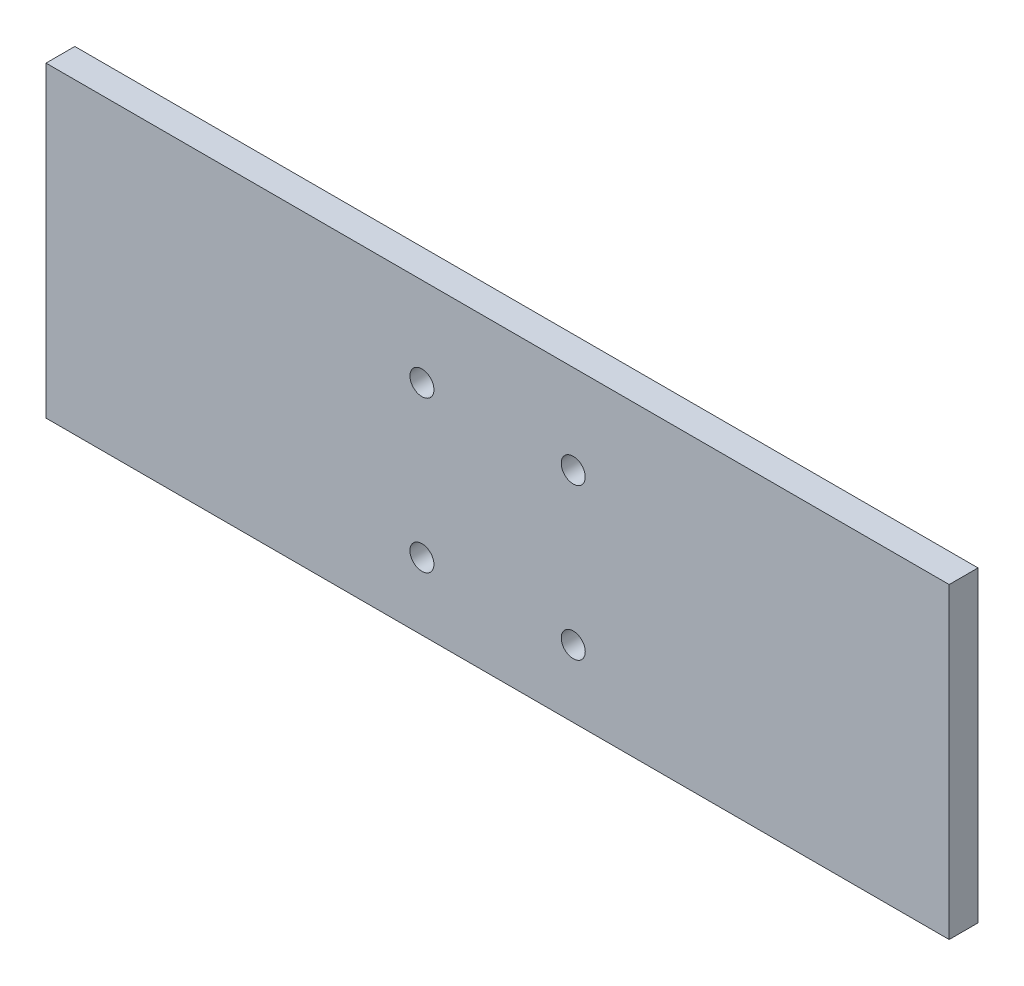
ISO-10303-21;
HEADER;
FILE_DESCRIPTION(('STEP AP214'),'2;1');
FILE_NAME('part.step','',(''),(''),'','','');
FILE_SCHEMA(('AUTOMOTIVE_DESIGN { 1 0 10303 214 1 1 1 1 }'));
ENDSEC;
DATA;
#1=APPLICATION_CONTEXT('core data for automotive mechanical design processes');
#2=APPLICATION_PROTOCOL_DEFINITION('international standard','automotive_design',2000,#1);
#3=PRODUCT_CONTEXT('',#1,'mechanical');
#4=PRODUCT('Part','Part','',(#3));
#5=PRODUCT_RELATED_PRODUCT_CATEGORY('part','',(#4));
#6=PRODUCT_DEFINITION_FORMATION('','',#4);
#7=PRODUCT_DEFINITION_CONTEXT('part definition',#1,'design');
#8=PRODUCT_DEFINITION('design','',#6,#7);
#9=PRODUCT_DEFINITION_SHAPE('','',#8);
#10=(LENGTH_UNIT() NAMED_UNIT(*) SI_UNIT(.MILLI.,.METRE.));
#11=(NAMED_UNIT(*) PLANE_ANGLE_UNIT() SI_UNIT($,.RADIAN.));
#12=(NAMED_UNIT(*) SI_UNIT($,.STERADIAN.) SOLID_ANGLE_UNIT());
#13=UNCERTAINTY_MEASURE_WITH_UNIT(LENGTH_MEASURE(1.E-05),#10,'distance_accuracy_value','');
#14=(GEOMETRIC_REPRESENTATION_CONTEXT(3) GLOBAL_UNCERTAINTY_ASSIGNED_CONTEXT((#13)) GLOBAL_UNIT_ASSIGNED_CONTEXT((#10,
#11,#12)) REPRESENTATION_CONTEXT('',''));
#15=CARTESIAN_POINT('',(0.,0.,0.));
#16=DIRECTION('',(0.,0.,1.));
#17=DIRECTION('',(1.,0.,0.));
#18=AXIS2_PLACEMENT_3D('',#15,#16,#17);
#19=CARTESIAN_POINT('',(-298.45,101.6,9.52499999999999));
#20=DIRECTION('',(1.,0.,0.));
#21=DIRECTION('',(0.,1.,0.));
#22=AXIS2_PLACEMENT_3D('',#19,#20,#21);
#23=PLANE('',#22);
#24=DIRECTION('',(0.,-1.,0.));
#25=VECTOR('',#24,1.);
#26=CARTESIAN_POINT('',(-298.45,101.6,-9.52499999999998));
#27=LINE('',#26,#25);
#28=CARTESIAN_POINT('',(-298.45,101.6,-9.52499999999998));
#29=VERTEX_POINT('',#28);
#30=CARTESIAN_POINT('',(-298.45,-101.6,-9.52499999999998));
#31=VERTEX_POINT('',#30);
#32=EDGE_CURVE('E95',#29,#31,#27,.T.);
#33=ORIENTED_EDGE('',*,*,#32,.T.);
#34=DIRECTION('',(0.,0.,-1.));
#35=VECTOR('',#34,1.);
#36=CARTESIAN_POINT('',(-298.45,-101.6,9.52500000000003));
#37=LINE('',#36,#35);
#38=CARTESIAN_POINT('',(-298.45,-101.6,9.52500000000003));
#39=VERTEX_POINT('',#38);
#40=EDGE_CURVE('E11',#39,#31,#37,.T.);
#41=ORIENTED_EDGE('',*,*,#40,.F.);
#42=DIRECTION('',(0.,-1.,0.));
#43=VECTOR('',#42,1.);
#44=CARTESIAN_POINT('',(-298.45,101.6,9.52499999999999));
#45=LINE('',#44,#43);
#46=CARTESIAN_POINT('',(-298.45,101.6,9.52499999999999));
#47=VERTEX_POINT('',#46);
#48=EDGE_CURVE('E83',#47,#39,#45,.T.);
#49=ORIENTED_EDGE('',*,*,#48,.F.);
#50=DIRECTION('',(0.,0.,-1.));
#51=VECTOR('',#50,1.);
#52=CARTESIAN_POINT('',(-298.45,101.6,9.52499999999999));
#53=LINE('',#52,#51);
#54=EDGE_CURVE('E91',#47,#29,#53,.T.);
#55=ORIENTED_EDGE('',*,*,#54,.T.);
#56=EDGE_LOOP('',(#33,#41,#49,#55));
#57=FACE_BOUND('',#56,.T.);
#58=ADVANCED_FACE('F32',(#57),#23,.F.);
#59=CARTESIAN_POINT('',(298.45,-101.6,9.52500000000001));
#60=DIRECTION('',(0.,1.,0.));
#61=DIRECTION('',(-1.,0.,0.));
#62=AXIS2_PLACEMENT_3D('',#59,#60,#61);
#63=PLANE('',#62);
#64=DIRECTION('',(1.,0.,0.));
#65=VECTOR('',#64,1.);
#66=CARTESIAN_POINT('',(298.45,-101.6,-9.52499999999996));
#67=LINE('',#66,#65);
#68=CARTESIAN_POINT('',(298.45,-101.6,-9.52499999999996));
#69=VERTEX_POINT('',#68);
#70=EDGE_CURVE('E87',#31,#69,#67,.T.);
#71=ORIENTED_EDGE('',*,*,#70,.T.);
#72=DIRECTION('',(0.,0.,-1.));
#73=VECTOR('',#72,1.);
#74=CARTESIAN_POINT('',(298.45,-101.6,9.52500000000001));
#75=LINE('',#74,#73);
#76=CARTESIAN_POINT('',(298.45,-101.6,9.52500000000001));
#77=VERTEX_POINT('',#76);
#78=EDGE_CURVE('E40',#77,#69,#75,.T.);
#79=ORIENTED_EDGE('',*,*,#78,.F.);
#80=DIRECTION('',(1.,0.,0.));
#81=VECTOR('',#80,1.);
#82=CARTESIAN_POINT('',(298.45,-101.6,9.52500000000001));
#83=LINE('',#82,#81);
#84=EDGE_CURVE('E78',#39,#77,#83,.T.);
#85=ORIENTED_EDGE('',*,*,#84,.F.);
#86=ORIENTED_EDGE('',*,*,#40,.T.);
#87=EDGE_LOOP('',(#71,#79,#85,#86));
#88=FACE_BOUND('',#87,.T.);
#89=ADVANCED_FACE('F86',(#88),#63,.F.);
#90=CARTESIAN_POINT('',(298.45,101.6,9.52500000000001));
#91=DIRECTION('',(-1.,0.,0.));
#92=DIRECTION('',(0.,0.,1.));
#93=AXIS2_PLACEMENT_3D('',#90,#91,#92);
#94=PLANE('',#93);
#95=DIRECTION('',(0.,1.,0.));
#96=VECTOR('',#95,1.);
#97=CARTESIAN_POINT('',(298.45,101.6,-9.52499999999998));
#98=LINE('',#97,#96);
#99=CARTESIAN_POINT('',(298.45,101.6,-9.52499999999998));
#100=VERTEX_POINT('',#99);
#101=EDGE_CURVE('E65',#69,#100,#98,.T.);
#102=ORIENTED_EDGE('',*,*,#101,.T.);
#103=DIRECTION('',(0.,0.,-1.));
#104=VECTOR('',#103,1.);
#105=CARTESIAN_POINT('',(298.45,101.6,9.52500000000001));
#106=LINE('',#105,#104);
#107=CARTESIAN_POINT('',(298.45,101.6,9.52500000000001));
#108=VERTEX_POINT('',#107);
#109=EDGE_CURVE('E88',#108,#100,#106,.T.);
#110=ORIENTED_EDGE('',*,*,#109,.F.);
#111=DIRECTION('',(0.,1.,0.));
#112=VECTOR('',#111,1.);
#113=CARTESIAN_POINT('',(298.45,101.6,9.52500000000001));
#114=LINE('',#113,#112);
#115=EDGE_CURVE('E81',#77,#108,#114,.T.);
#116=ORIENTED_EDGE('',*,*,#115,.F.);
#117=ORIENTED_EDGE('',*,*,#78,.T.);
#118=EDGE_LOOP('',(#102,#110,#116,#117));
#119=FACE_BOUND('',#118,.T.);
#120=ADVANCED_FACE('F89',(#119),#94,.F.);
#121=CARTESIAN_POINT('',(298.45,101.6,9.52500000000001));
#122=DIRECTION('',(0.,-1.,0.));
#123=DIRECTION('',(1.,0.,0.));
#124=AXIS2_PLACEMENT_3D('',#121,#122,#123);
#125=PLANE('',#124);
#126=DIRECTION('',(-1.,0.,0.));
#127=VECTOR('',#126,1.);
#128=CARTESIAN_POINT('',(298.45,101.6,-9.52499999999998));
#129=LINE('',#128,#127);
#130=EDGE_CURVE('E71',#100,#29,#129,.T.);
#131=ORIENTED_EDGE('',*,*,#130,.T.);
#132=ORIENTED_EDGE('',*,*,#54,.F.);
#133=DIRECTION('',(-1.,0.,0.));
#134=VECTOR('',#133,1.);
#135=CARTESIAN_POINT('',(298.45,101.6,9.52500000000001));
#136=LINE('',#135,#134);
#137=EDGE_CURVE('E48',#108,#47,#136,.T.);
#138=ORIENTED_EDGE('',*,*,#137,.F.);
#139=ORIENTED_EDGE('',*,*,#109,.T.);
#140=EDGE_LOOP('',(#131,#132,#138,#139));
#141=FACE_BOUND('',#140,.T.);
#142=ADVANCED_FACE('F103',(#141),#125,.F.);
#143=CARTESIAN_POINT('',(0.,0.,9.52500000000001));
#144=DIRECTION('',(0.,0.,-1.));
#145=DIRECTION('',(-1.,0.,0.));
#146=AXIS2_PLACEMENT_3D('',#143,#144,#145);
#147=PLANE('',#146);
#148=CARTESIAN_POINT('',(-50.,-57.15,9.52500000000003));
#149=DIRECTION('',(0.,0.,1.));
#150=DIRECTION('',(1.,0.,0.));
#151=AXIS2_PLACEMENT_3D('',#148,#149,#150);
#152=CIRCLE('',#151,7.9375);
#153=CARTESIAN_POINT('',(-42.0625,-57.15,9.52500000000003));
#154=VERTEX_POINT('',#153);
#155=EDGE_CURVE('E122',#154,#154,#152,.T.);
#156=ORIENTED_EDGE('',*,*,#155,.F.);
#157=EDGE_LOOP('',(#156));
#158=FACE_BOUND('',#157,.T.);
#159=CARTESIAN_POINT('',(49.9999999999999,42.8499999999999,9.52499999999999));
#160=DIRECTION('',(0.,0.,1.));
#161=DIRECTION('',(1.,0.,0.));
#162=AXIS2_PLACEMENT_3D('',#159,#160,#161);
#163=CIRCLE('',#162,7.9375);
#164=CARTESIAN_POINT('',(57.9374999999999,42.8499999999999,9.52499999999999));
#165=VERTEX_POINT('',#164);
#166=EDGE_CURVE('E115',#165,#165,#163,.T.);
#167=ORIENTED_EDGE('',*,*,#166,.F.);
#168=EDGE_LOOP('',(#167));
#169=FACE_BOUND('',#168,.T.);
#170=CARTESIAN_POINT('',(50.,-57.15,9.52500000000002));
#171=DIRECTION('',(0.,0.,1.));
#172=DIRECTION('',(1.,0.,0.));
#173=AXIS2_PLACEMENT_3D('',#170,#171,#172);
#174=CIRCLE('',#173,7.9375);
#175=CARTESIAN_POINT('',(57.9375,-57.15,9.52500000000002));
#176=VERTEX_POINT('',#175);
#177=EDGE_CURVE('E127',#176,#176,#174,.T.);
#178=ORIENTED_EDGE('',*,*,#177,.F.);
#179=EDGE_LOOP('',(#178));
#180=FACE_BOUND('',#179,.T.);
#181=CARTESIAN_POINT('',(-50.0000000000001,42.85,9.52500000000002));
#182=DIRECTION('',(0.,0.,1.));
#183=DIRECTION('',(1.,0.,0.));
#184=AXIS2_PLACEMENT_3D('',#181,#182,#183);
#185=CIRCLE('',#184,7.9375);
#186=CARTESIAN_POINT('',(-42.0625000000001,42.85,9.52500000000002));
#187=VERTEX_POINT('',#186);
#188=EDGE_CURVE('E109',#187,#187,#185,.T.);
#189=ORIENTED_EDGE('',*,*,#188,.F.);
#190=EDGE_LOOP('',(#189));
#191=FACE_BOUND('',#190,.T.);
#192=ORIENTED_EDGE('',*,*,#48,.T.);
#193=ORIENTED_EDGE('',*,*,#84,.T.);
#194=ORIENTED_EDGE('',*,*,#115,.T.);
#195=ORIENTED_EDGE('',*,*,#137,.T.);
#196=EDGE_LOOP('',(#192,#193,#194,#195));
#197=FACE_BOUND('',#196,.T.);
#198=ADVANCED_FACE('F79',(#158,#169,#180,#191,#197),#147,.F.);
#199=CARTESIAN_POINT('',(0.,0.,-9.52500000000001));
#200=DIRECTION('',(0.,0.,-1.));
#201=DIRECTION('',(-1.,0.,0.));
#202=AXIS2_PLACEMENT_3D('',#199,#200,#201);
#203=PLANE('',#202);
#204=CARTESIAN_POINT('',(-50.,-57.15,-9.52499999999996));
#205=DIRECTION('',(0.,0.,1.));
#206=DIRECTION('',(1.,0.,0.));
#207=AXIS2_PLACEMENT_3D('',#204,#205,#206);
#208=CIRCLE('',#207,7.9375);
#209=CARTESIAN_POINT('',(-42.0625,-57.15,-9.52499999999996));
#210=VERTEX_POINT('',#209);
#211=EDGE_CURVE('E112',#210,#210,#208,.T.);
#212=ORIENTED_EDGE('',*,*,#211,.T.);
#213=EDGE_LOOP('',(#212));
#214=FACE_BOUND('',#213,.T.);
#215=CARTESIAN_POINT('',(50.,42.8499999999999,-9.52499999999996));
#216=DIRECTION('',(0.,0.,1.));
#217=DIRECTION('',(1.,0.,0.));
#218=AXIS2_PLACEMENT_3D('',#215,#216,#217);
#219=CIRCLE('',#218,7.9375);
#220=CARTESIAN_POINT('',(57.9375,42.8499999999999,-9.52499999999996));
#221=VERTEX_POINT('',#220);
#222=EDGE_CURVE('E118',#221,#221,#219,.T.);
#223=ORIENTED_EDGE('',*,*,#222,.T.);
#224=EDGE_LOOP('',(#223));
#225=FACE_BOUND('',#224,.T.);
#226=CARTESIAN_POINT('',(50.,-57.15,-9.52499999999998));
#227=DIRECTION('',(0.,0.,1.));
#228=DIRECTION('',(1.,0.,0.));
#229=AXIS2_PLACEMENT_3D('',#226,#227,#228);
#230=CIRCLE('',#229,7.9375);
#231=CARTESIAN_POINT('',(57.9375,-57.15,-9.52499999999998));
#232=VERTEX_POINT('',#231);
#233=EDGE_CURVE('E119',#232,#232,#230,.T.);
#234=ORIENTED_EDGE('',*,*,#233,.T.);
#235=EDGE_LOOP('',(#234));
#236=FACE_BOUND('',#235,.T.);
#237=CARTESIAN_POINT('',(-50.,42.8499999999999,-9.52499999999999));
#238=DIRECTION('',(0.,0.,1.));
#239=DIRECTION('',(1.,0.,0.));
#240=AXIS2_PLACEMENT_3D('',#237,#238,#239);
#241=CIRCLE('',#240,7.9375);
#242=CARTESIAN_POINT('',(-42.0625,42.8499999999999,-9.52499999999999));
#243=VERTEX_POINT('',#242);
#244=EDGE_CURVE('E98',#243,#243,#241,.T.);
#245=ORIENTED_EDGE('',*,*,#244,.T.);
#246=EDGE_LOOP('',(#245));
#247=FACE_BOUND('',#246,.T.);
#248=ORIENTED_EDGE('',*,*,#32,.F.);
#249=ORIENTED_EDGE('',*,*,#130,.F.);
#250=ORIENTED_EDGE('',*,*,#101,.F.);
#251=ORIENTED_EDGE('',*,*,#70,.F.);
#252=EDGE_LOOP('',(#248,#249,#250,#251));
#253=FACE_BOUND('',#252,.T.);
#254=ADVANCED_FACE('F106',(#214,#225,#236,#247,#253),#203,.T.);
#255=CARTESIAN_POINT('',(-50.,42.8499999999999,-9.52499999999999));
#256=DIRECTION('',(0.,0.,1.));
#257=DIRECTION('',(1.,0.,0.));
#258=AXIS2_PLACEMENT_3D('',#255,#256,#257);
#259=CYLINDRICAL_SURFACE('',#258,7.9375);
#260=ORIENTED_EDGE('',*,*,#244,.F.);
#261=EDGE_LOOP('',(#260));
#262=FACE_BOUND('',#261,.T.);
#263=ORIENTED_EDGE('',*,*,#188,.T.);
#264=EDGE_LOOP('',(#263));
#265=FACE_BOUND('',#264,.T.);
#266=ADVANCED_FACE('F139',(#262,#265),#259,.F.);
#267=CARTESIAN_POINT('',(50.,-57.15,-9.52499999999998));
#268=DIRECTION('',(0.,0.,1.));
#269=DIRECTION('',(1.,0.,0.));
#270=AXIS2_PLACEMENT_3D('',#267,#268,#269);
#271=CYLINDRICAL_SURFACE('',#270,7.9375);
#272=ORIENTED_EDGE('',*,*,#233,.F.);
#273=EDGE_LOOP('',(#272));
#274=FACE_BOUND('',#273,.T.);
#275=ORIENTED_EDGE('',*,*,#177,.T.);
#276=EDGE_LOOP('',(#275));
#277=FACE_BOUND('',#276,.T.);
#278=ADVANCED_FACE('F135',(#274,#277),#271,.F.);
#279=CARTESIAN_POINT('',(50.,42.8499999999999,-9.52499999999996));
#280=DIRECTION('',(0.,0.,1.));
#281=DIRECTION('',(1.,0.,0.));
#282=AXIS2_PLACEMENT_3D('',#279,#280,#281);
#283=CYLINDRICAL_SURFACE('',#282,7.9375);
#284=ORIENTED_EDGE('',*,*,#222,.F.);
#285=EDGE_LOOP('',(#284));
#286=FACE_BOUND('',#285,.T.);
#287=ORIENTED_EDGE('',*,*,#166,.T.);
#288=EDGE_LOOP('',(#287));
#289=FACE_BOUND('',#288,.T.);
#290=ADVANCED_FACE('F138',(#286,#289),#283,.F.);
#291=CARTESIAN_POINT('',(-50.,-57.15,-9.52499999999996));
#292=DIRECTION('',(0.,0.,1.));
#293=DIRECTION('',(1.,0.,0.));
#294=AXIS2_PLACEMENT_3D('',#291,#292,#293);
#295=CYLINDRICAL_SURFACE('',#294,7.9375);
#296=ORIENTED_EDGE('',*,*,#211,.F.);
#297=EDGE_LOOP('',(#296));
#298=FACE_BOUND('',#297,.T.);
#299=ORIENTED_EDGE('',*,*,#155,.T.);
#300=EDGE_LOOP('',(#299));
#301=FACE_BOUND('',#300,.T.);
#302=ADVANCED_FACE('F200',(#298,#301),#295,.F.);
#303=CLOSED_SHELL('',(#58,#89,#120,#142,#198,#254,#266,#278,#290,#302));
#304=MANIFOLD_SOLID_BREP('B2',#303);
#305=ADVANCED_BREP_SHAPE_REPRESENTATION('',(#18,#304),#14);
#306=SHAPE_DEFINITION_REPRESENTATION(#9,#305);
ENDSEC;
END-ISO-10303-21;
